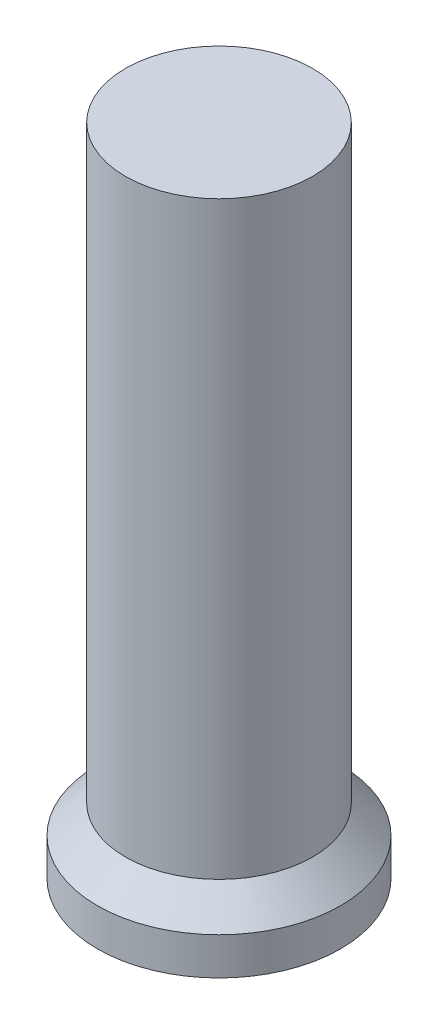
ISO-10303-21;
HEADER;
FILE_DESCRIPTION(('STEP AP214'),'2;1');
FILE_NAME('part.step','',(''),(''),'','','');
FILE_SCHEMA(('AUTOMOTIVE_DESIGN { 1 0 10303 214 1 1 1 1 }'));
ENDSEC;
DATA;
#1=APPLICATION_CONTEXT('core data for automotive mechanical design processes');
#2=APPLICATION_PROTOCOL_DEFINITION('international standard','automotive_design',2000,#1);
#3=PRODUCT_CONTEXT('',#1,'mechanical');
#4=PRODUCT('Part','Part','',(#3));
#5=PRODUCT_RELATED_PRODUCT_CATEGORY('part','',(#4));
#6=PRODUCT_DEFINITION_FORMATION('','',#4);
#7=PRODUCT_DEFINITION_CONTEXT('part definition',#1,'design');
#8=PRODUCT_DEFINITION('design','',#6,#7);
#9=PRODUCT_DEFINITION_SHAPE('','',#8);
#10=(LENGTH_UNIT() NAMED_UNIT(*) SI_UNIT(.MILLI.,.METRE.));
#11=(NAMED_UNIT(*) PLANE_ANGLE_UNIT() SI_UNIT($,.RADIAN.));
#12=(NAMED_UNIT(*) SI_UNIT($,.STERADIAN.) SOLID_ANGLE_UNIT());
#13=UNCERTAINTY_MEASURE_WITH_UNIT(LENGTH_MEASURE(1.E-05),#10,'distance_accuracy_value','');
#14=(GEOMETRIC_REPRESENTATION_CONTEXT(3) GLOBAL_UNCERTAINTY_ASSIGNED_CONTEXT((#13)) GLOBAL_UNIT_ASSIGNED_CONTEXT((#10,
#11,#12)) REPRESENTATION_CONTEXT('',''));
#15=CARTESIAN_POINT('',(0.,0.,0.));
#16=DIRECTION('',(0.,0.,1.));
#17=DIRECTION('',(1.,0.,0.));
#18=AXIS2_PLACEMENT_3D('',#15,#16,#17);
#19=CARTESIAN_POINT('',(0.,35.,0.));
#20=DIRECTION('',(0.,-1.,0.));
#21=DIRECTION('',(0.,0.,-1.));
#22=AXIS2_PLACEMENT_3D('',#19,#20,#21);
#23=CYLINDRICAL_SURFACE('',#22,6.5);
#24=CARTESIAN_POINT('',(0.,1.99999999999998,0.));
#25=DIRECTION('',(0.,1.,0.));
#26=DIRECTION('',(0.,0.,1.));
#27=AXIS2_PLACEMENT_3D('',#24,#25,#26);
#28=CIRCLE('',#27,6.5);
#29=CARTESIAN_POINT('',(0.,1.99999999999998,-6.5));
#30=VERTEX_POINT('',#29);
#31=EDGE_CURVE('E40',#30,#30,#28,.F.);
#32=ORIENTED_EDGE('',*,*,#31,.T.);
#33=EDGE_LOOP('',(#32));
#34=FACE_BOUND('',#33,.T.);
#35=CARTESIAN_POINT('',(0.,0.,0.));
#36=DIRECTION('',(0.,1.,0.));
#37=DIRECTION('',(0.,0.,1.));
#38=AXIS2_PLACEMENT_3D('',#35,#36,#37);
#39=CIRCLE('',#38,6.5);
#40=CARTESIAN_POINT('',(0.,0.,6.5));
#41=VERTEX_POINT('',#40);
#42=EDGE_CURVE('E44',#41,#41,#39,.T.);
#43=ORIENTED_EDGE('',*,*,#42,.T.);
#44=EDGE_LOOP('',(#43));
#45=FACE_BOUND('',#44,.T.);
#46=ADVANCED_FACE('F33',(#34,#45),#23,.T.);
#47=CARTESIAN_POINT('',(0.,0.,0.));
#48=DIRECTION('',(0.,1.,0.));
#49=DIRECTION('',(0.,0.,1.));
#50=AXIS2_PLACEMENT_3D('',#47,#48,#49);
#51=PLANE('',#50);
#52=ORIENTED_EDGE('',*,*,#42,.F.);
#53=EDGE_LOOP('',(#52));
#54=FACE_BOUND('',#53,.T.);
#55=ADVANCED_FACE('F58',(#54),#51,.F.);
#56=CARTESIAN_POINT('',(0.,5.,0.));
#57=DIRECTION('',(0.,1.,0.));
#58=DIRECTION('',(0.,0.,1.));
#59=AXIS2_PLACEMENT_3D('',#56,#57,#58);
#60=CYLINDRICAL_SURFACE('',#59,5.);
#61=CARTESIAN_POINT('',(0.,3.49999999999997,0.));
#62=DIRECTION('',(0.,-1.,0.));
#63=DIRECTION('',(0.,0.,-1.));
#64=AXIS2_PLACEMENT_3D('',#61,#62,#63);
#65=CIRCLE('',#64,5.);
#66=CARTESIAN_POINT('',(0.,3.49999999999997,-5.));
#67=VERTEX_POINT('',#66);
#68=EDGE_CURVE('E10',#67,#67,#65,.F.);
#69=ORIENTED_EDGE('',*,*,#68,.T.);
#70=EDGE_LOOP('',(#69));
#71=FACE_BOUND('',#70,.T.);
#72=CARTESIAN_POINT('',(0.,35.,0.));
#73=DIRECTION('',(0.,1.,0.));
#74=DIRECTION('',(0.,0.,1.));
#75=AXIS2_PLACEMENT_3D('',#72,#73,#74);
#76=CIRCLE('',#75,5.);
#77=CARTESIAN_POINT('',(0.,35.,5.));
#78=VERTEX_POINT('',#77);
#79=EDGE_CURVE('E48',#78,#78,#76,.T.);
#80=ORIENTED_EDGE('',*,*,#79,.F.);
#81=EDGE_LOOP('',(#80));
#82=FACE_BOUND('',#81,.T.);
#83=ADVANCED_FACE('F56',(#71,#82),#60,.T.);
#84=CARTESIAN_POINT('',(0.,35.,0.));
#85=DIRECTION('',(0.,1.,0.));
#86=DIRECTION('',(0.,0.,1.));
#87=AXIS2_PLACEMENT_3D('',#84,#85,#86);
#88=PLANE('',#87);
#89=ORIENTED_EDGE('',*,*,#79,.T.);
#90=EDGE_LOOP('',(#89));
#91=FACE_BOUND('',#90,.T.);
#92=ADVANCED_FACE('F54',(#91),#88,.T.);
#93=CARTESIAN_POINT('',(0.,5.,0.));
#94=DIRECTION('',(0.,-1.,0.));
#95=DIRECTION('',(0.,0.,-1.));
#96=AXIS2_PLACEMENT_3D('',#93,#94,#95);
#97=CONICAL_SURFACE('',#96,3.49999999999995,0.785398163397453);
#98=CARTESIAN_POINT('',(0.,1.99999999999998,-6.5));
#99=CARTESIAN_POINT('',(0.,2.01562499999998,-6.484375));
#100=CARTESIAN_POINT('',(0.,2.03124999999998,-6.46875));
#101=CARTESIAN_POINT('',(0.,2.06249999999998,-6.4375));
#102=CARTESIAN_POINT('',(0.,2.07812499999998,-6.421875));
#103=CARTESIAN_POINT('',(0.,2.10937499999998,-6.390625));
#104=CARTESIAN_POINT('',(0.,2.12499999999998,-6.375));
#105=CARTESIAN_POINT('',(0.,2.15624999999998,-6.34375));
#106=CARTESIAN_POINT('',(0.,2.17187499999998,-6.328125));
#107=CARTESIAN_POINT('',(0.,2.20312499999998,-6.296875));
#108=CARTESIAN_POINT('',(0.,2.21874999999998,-6.28125));
#109=CARTESIAN_POINT('',(0.,2.24999999999998,-6.25));
#110=CARTESIAN_POINT('',(0.,2.26562499999998,-6.234375));
#111=CARTESIAN_POINT('',(0.,2.29687499999998,-6.203125));
#112=CARTESIAN_POINT('',(0.,2.31249999999998,-6.1875));
#113=CARTESIAN_POINT('',(0.,2.34374999999998,-6.15625));
#114=CARTESIAN_POINT('',(0.,2.35937499999998,-6.140625));
#115=CARTESIAN_POINT('',(0.,2.39062499999998,-6.109375));
#116=CARTESIAN_POINT('',(0.,2.40624999999998,-6.09375));
#117=CARTESIAN_POINT('',(0.,2.43749999999998,-6.0625));
#118=CARTESIAN_POINT('',(0.,2.45312499999998,-6.046875));
#119=CARTESIAN_POINT('',(0.,2.48437499999998,-6.015625));
#120=CARTESIAN_POINT('',(0.,2.49999999999998,-6.));
#121=CARTESIAN_POINT('',(0.,2.53124999999998,-5.96875));
#122=CARTESIAN_POINT('',(0.,2.54687499999998,-5.953125));
#123=CARTESIAN_POINT('',(0.,2.57812499999998,-5.921875));
#124=CARTESIAN_POINT('',(0.,2.59374999999998,-5.90625));
#125=CARTESIAN_POINT('',(0.,2.62499999999998,-5.875));
#126=CARTESIAN_POINT('',(0.,2.64062499999998,-5.859375));
#127=CARTESIAN_POINT('',(0.,2.67187499999998,-5.828125));
#128=CARTESIAN_POINT('',(0.,2.68749999999998,-5.8125));
#129=CARTESIAN_POINT('',(0.,2.71874999999998,-5.78125));
#130=CARTESIAN_POINT('',(0.,2.73437499999997,-5.765625));
#131=CARTESIAN_POINT('',(0.,2.76562499999997,-5.734375));
#132=CARTESIAN_POINT('',(0.,2.78124999999997,-5.71875));
#133=CARTESIAN_POINT('',(0.,2.81249999999997,-5.6875));
#134=CARTESIAN_POINT('',(0.,2.82812499999997,-5.671875));
#135=CARTESIAN_POINT('',(0.,2.85937499999997,-5.640625));
#136=CARTESIAN_POINT('',(0.,2.87499999999997,-5.625));
#137=CARTESIAN_POINT('',(0.,2.90624999999997,-5.59375));
#138=CARTESIAN_POINT('',(0.,2.92187499999997,-5.578125));
#139=CARTESIAN_POINT('',(0.,2.95312499999997,-5.546875));
#140=CARTESIAN_POINT('',(0.,2.96874999999997,-5.53125));
#141=CARTESIAN_POINT('',(0.,2.99999999999997,-5.5));
#142=CARTESIAN_POINT('',(0.,3.01562499999997,-5.484375));
#143=CARTESIAN_POINT('',(0.,3.04687499999997,-5.453125));
#144=CARTESIAN_POINT('',(0.,3.06249999999997,-5.4375));
#145=CARTESIAN_POINT('',(0.,3.09374999999997,-5.40625));
#146=CARTESIAN_POINT('',(0.,3.10937499999997,-5.390625));
#147=CARTESIAN_POINT('',(0.,3.14062499999997,-5.359375));
#148=CARTESIAN_POINT('',(0.,3.15624999999997,-5.34375));
#149=CARTESIAN_POINT('',(0.,3.18749999999997,-5.3125));
#150=CARTESIAN_POINT('',(0.,3.20312499999997,-5.296875));
#151=CARTESIAN_POINT('',(0.,3.23437499999997,-5.265625));
#152=CARTESIAN_POINT('',(0.,3.24999999999997,-5.25));
#153=CARTESIAN_POINT('',(0.,3.28124999999997,-5.21875));
#154=CARTESIAN_POINT('',(0.,3.29687499999997,-5.203125));
#155=CARTESIAN_POINT('',(0.,3.32812499999997,-5.171875));
#156=CARTESIAN_POINT('',(0.,3.34374999999997,-5.15625));
#157=CARTESIAN_POINT('',(0.,3.37499999999997,-5.125));
#158=CARTESIAN_POINT('',(0.,3.39062499999997,-5.109375));
#159=CARTESIAN_POINT('',(0.,3.42187499999997,-5.078125));
#160=CARTESIAN_POINT('',(0.,3.43749999999997,-5.0625));
#161=CARTESIAN_POINT('',(0.,3.46874999999997,-5.03125));
#162=CARTESIAN_POINT('',(0.,3.48437499999997,-5.015625));
#163=CARTESIAN_POINT('',(0.,3.49999999999997,-5.));
#164=B_SPLINE_CURVE_WITH_KNOTS('',3,(#98,#99,#100,#101,#102,#103,#104,#105,#106,#107,#108,#109,
#110,#111,#112,#113,#114,#115,#116,#117,#118,#119,#120,#121,#122,#123,#124,#125,#126,#127,#128,
#129,#130,#131,#132,#133,#134,#135,#136,#137,#138,#139,#140,#141,#142,#143,#144,#145,#146,#147,
#148,#149,#150,#151,#152,#153,#154,#155,#156,#157,#158,#159,#160,#161,#162,#163),.UNSPECIFIED.,
.F.,.F.,(4,2,2,2,2,2,2,2,2,2,2,2,2,2,2,2,2,2,2,2,2,2,2,2,2,2,2,2,2,2,2,2,4),(0.,
0.0662912607362386,0.132582521472478,0.198873782208716,0.265165042944955,0.331456303681194,
0.397747564417432,0.464038825153672,0.530330085889909,0.596621346626149,0.662912607362387,
0.729203868098626,0.795495128834865,0.861786389571103,0.928077650307342,0.99436891104358,
1.06066017177982,1.12695143251606,1.1932426932523,1.25953395398853,1.32582521472477,
1.39211647546101,1.45840773619725,1.52469899693349,1.59099025766973,1.65728151840597,
1.7235727791422,1.78986403987844,1.85615530061468,1.92244656135092,1.98873782208716,
2.0550290828234,2.12132034355964),.UNSPECIFIED.);
#165=EDGE_CURVE('BSEAM35',#30,#67,#164,.T.);
#166=ORIENTED_EDGE('',*,*,#31,.F.);
#167=ORIENTED_EDGE('',*,*,#68,.F.);
#168=ORIENTED_EDGE('',*,*,#165,.T.);
#169=ORIENTED_EDGE('',*,*,#165,.F.);
#170=EDGE_LOOP('',(#166,#168,#167,#169));
#171=FACE_BOUND('',#170,.T.);
#172=ADVANCED_FACE('F35',(#171),#97,.T.);
#173=CLOSED_SHELL('',(#46,#55,#83,#92,#172));
#174=MANIFOLD_SOLID_BREP('B2',#173);
#175=ADVANCED_BREP_SHAPE_REPRESENTATION('',(#18,#174),#14);
#176=SHAPE_DEFINITION_REPRESENTATION(#9,#175);
ENDSEC;
END-ISO-10303-21;
